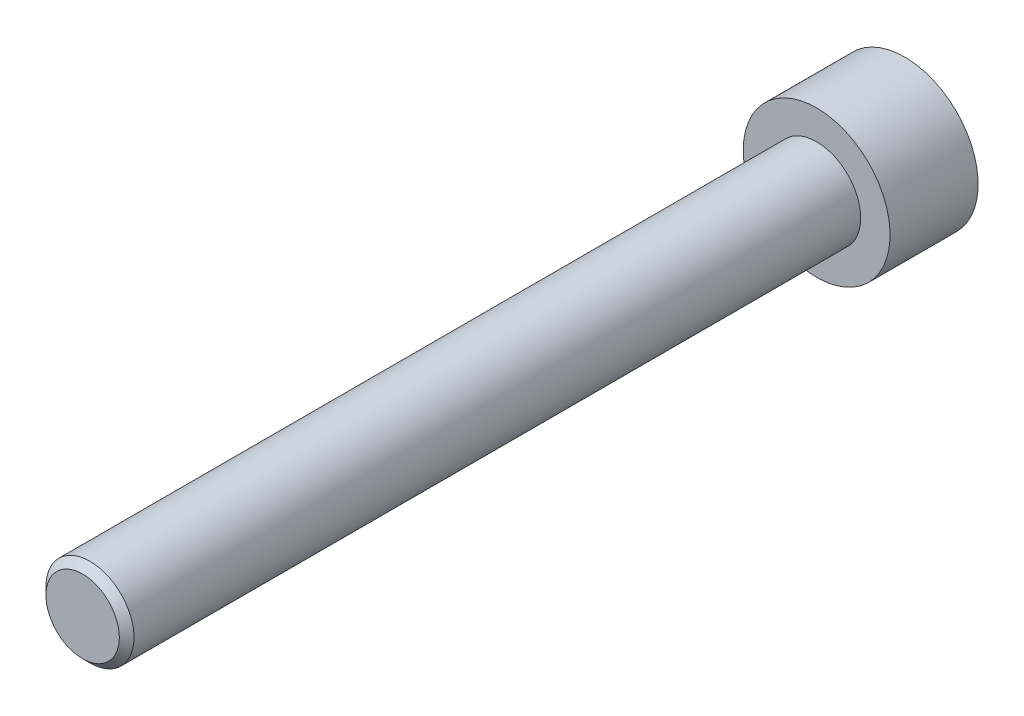
ISO-10303-21;
HEADER;
FILE_DESCRIPTION(('STEP AP214'),'2;1');
FILE_NAME('part.step','',(''),(''),'','','');
FILE_SCHEMA(('AUTOMOTIVE_DESIGN { 1 0 10303 214 1 1 1 1 }'));
ENDSEC;
DATA;
#1=APPLICATION_CONTEXT('core data for automotive mechanical design processes');
#2=APPLICATION_PROTOCOL_DEFINITION('international standard','automotive_design',2000,#1);
#3=PRODUCT_CONTEXT('',#1,'mechanical');
#4=PRODUCT('Part','Part','',(#3));
#5=PRODUCT_RELATED_PRODUCT_CATEGORY('part','',(#4));
#6=PRODUCT_DEFINITION_FORMATION('','',#4);
#7=PRODUCT_DEFINITION_CONTEXT('part definition',#1,'design');
#8=PRODUCT_DEFINITION('design','',#6,#7);
#9=PRODUCT_DEFINITION_SHAPE('','',#8);
#10=(LENGTH_UNIT() NAMED_UNIT(*) SI_UNIT(.MILLI.,.METRE.));
#11=(NAMED_UNIT(*) PLANE_ANGLE_UNIT() SI_UNIT($,.RADIAN.));
#12=(NAMED_UNIT(*) SI_UNIT($,.STERADIAN.) SOLID_ANGLE_UNIT());
#13=UNCERTAINTY_MEASURE_WITH_UNIT(LENGTH_MEASURE(1.E-05),#10,'distance_accuracy_value','');
#14=(GEOMETRIC_REPRESENTATION_CONTEXT(3) GLOBAL_UNCERTAINTY_ASSIGNED_CONTEXT((#13)) GLOBAL_UNIT_ASSIGNED_CONTEXT((#10,
#11,#12)) REPRESENTATION_CONTEXT('',''));
#15=CARTESIAN_POINT('',(0.,0.,0.));
#16=DIRECTION('',(0.,0.,1.));
#17=DIRECTION('',(1.,0.,0.));
#18=AXIS2_PLACEMENT_3D('',#15,#16,#17);
#19=CARTESIAN_POINT('',(0.,0.,-55.2));
#20=DIRECTION('',(0.,0.,1.));
#21=DIRECTION('',(1.,0.,0.));
#22=AXIS2_PLACEMENT_3D('',#19,#20,#21);
#23=CYLINDRICAL_SURFACE('',#22,3.);
#24=CARTESIAN_POINT('',(0.,0.,0.299999999999995));
#25=DIRECTION('',(0.,0.,1.));
#26=DIRECTION('',(1.,0.,0.));
#27=AXIS2_PLACEMENT_3D('',#24,#25,#26);
#28=CIRCLE('',#27,3.);
#29=CARTESIAN_POINT('',(3.,0.,0.299999999999995));
#30=VERTEX_POINT('',#29);
#31=EDGE_CURVE('E50',#30,#30,#28,.F.);
#32=ORIENTED_EDGE('',*,*,#31,.T.);
#33=EDGE_LOOP('',(#32));
#34=FACE_BOUND('',#33,.T.);
#35=CARTESIAN_POINT('',(0.,0.,-49.2));
#36=DIRECTION('',(0.,0.,-1.));
#37=DIRECTION('',(-1.,0.,0.));
#38=AXIS2_PLACEMENT_3D('',#35,#36,#37);
#39=CIRCLE('',#38,3.);
#40=CARTESIAN_POINT('',(-3.,0.,-49.2));
#41=VERTEX_POINT('',#40);
#42=EDGE_CURVE('E45',#41,#41,#39,.F.);
#43=ORIENTED_EDGE('',*,*,#42,.T.);
#44=EDGE_LOOP('',(#43));
#45=FACE_BOUND('',#44,.T.);
#46=ADVANCED_FACE('F40',(#34,#45),#23,.T.);
#47=CARTESIAN_POINT('',(0.,0.,0.8));
#48=DIRECTION('',(0.,0.,1.));
#49=DIRECTION('',(1.,0.,0.));
#50=AXIS2_PLACEMENT_3D('',#47,#48,#49);
#51=PLANE('',#50);
#52=CARTESIAN_POINT('',(0.,0.,0.8));
#53=DIRECTION('',(0.,0.,1.));
#54=DIRECTION('',(1.,0.,0.));
#55=AXIS2_PLACEMENT_3D('',#52,#53,#54);
#56=CIRCLE('',#55,2.5);
#57=CARTESIAN_POINT('',(2.5,0.,0.8));
#58=VERTEX_POINT('',#57);
#59=EDGE_CURVE('E11',#58,#58,#56,.T.);
#60=ORIENTED_EDGE('',*,*,#59,.T.);
#61=EDGE_LOOP('',(#60));
#62=FACE_BOUND('',#61,.T.);
#63=ADVANCED_FACE('F187',(#62),#51,.T.);
#64=CARTESIAN_POINT('',(0.,0.,0.800000000000002));
#65=DIRECTION('',(0.,0.,-1.));
#66=DIRECTION('',(-1.,0.,0.));
#67=AXIS2_PLACEMENT_3D('',#64,#65,#66);
#68=CONICAL_SURFACE('',#67,2.5,0.785398163397446);
#69=ORIENTED_EDGE('',*,*,#31,.F.);
#70=EDGE_LOOP('',(#69));
#71=FACE_BOUND('',#70,.T.);
#72=ORIENTED_EDGE('',*,*,#59,.F.);
#73=EDGE_LOOP('',(#72));
#74=FACE_BOUND('',#73,.T.);
#75=ADVANCED_FACE('F43',(#71,#74),#68,.T.);
#76=CARTESIAN_POINT('',(0.,0.,-49.2));
#77=DIRECTION('',(0.,0.,-1.));
#78=DIRECTION('',(-1.,0.,0.));
#79=AXIS2_PLACEMENT_3D('',#76,#77,#78);
#80=CYLINDRICAL_SURFACE('',#79,5.);
#81=CARTESIAN_POINT('',(0.,0.,-49.2));
#82=DIRECTION('',(0.,0.,-1.));
#83=DIRECTION('',(-1.,0.,0.));
#84=AXIS2_PLACEMENT_3D('',#81,#82,#83);
#85=CIRCLE('',#84,5.);
#86=CARTESIAN_POINT('',(-5.,0.,-49.2));
#87=VERTEX_POINT('',#86);
#88=EDGE_CURVE('E150',#87,#87,#85,.T.);
#89=ORIENTED_EDGE('',*,*,#88,.T.);
#90=EDGE_LOOP('',(#89));
#91=FACE_BOUND('',#90,.T.);
#92=CARTESIAN_POINT('',(0.,0.,-55.2));
#93=DIRECTION('',(0.,0.,-1.));
#94=DIRECTION('',(-1.,0.,0.));
#95=AXIS2_PLACEMENT_3D('',#92,#93,#94);
#96=CIRCLE('',#95,5.);
#97=CARTESIAN_POINT('',(-5.,0.,-55.2));
#98=VERTEX_POINT('',#97);
#99=EDGE_CURVE('E144',#98,#98,#96,.T.);
#100=ORIENTED_EDGE('',*,*,#99,.F.);
#101=EDGE_LOOP('',(#100));
#102=FACE_BOUND('',#101,.T.);
#103=ADVANCED_FACE('F166',(#91,#102),#80,.T.);
#104=CARTESIAN_POINT('',(0.,0.,-49.2));
#105=DIRECTION('',(0.,0.,-1.));
#106=DIRECTION('',(-1.,0.,0.));
#107=AXIS2_PLACEMENT_3D('',#104,#105,#106);
#108=PLANE('',#107);
#109=ORIENTED_EDGE('',*,*,#42,.F.);
#110=EDGE_LOOP('',(#109));
#111=FACE_BOUND('',#110,.T.);
#112=ORIENTED_EDGE('',*,*,#88,.F.);
#113=EDGE_LOOP('',(#112));
#114=FACE_BOUND('',#113,.T.);
#115=ADVANCED_FACE('F162',(#111,#114),#108,.F.);
#116=CARTESIAN_POINT('',(0.,0.,-55.2));
#117=DIRECTION('',(0.,0.,1.));
#118=DIRECTION('',(1.,0.,0.));
#119=AXIS2_PLACEMENT_3D('',#116,#117,#118);
#120=PLANE('',#119);
#121=DIRECTION('',(0.499999999999998,0.86602540378444,0.));
#122=VECTOR('',#121,1.);
#123=CARTESIAN_POINT('',(-1.5,3.,-55.2));
#124=LINE('',#123,#122);
#125=CARTESIAN_POINT('',(-3.23205080756887,0.,-55.2));
#126=VERTEX_POINT('',#125);
#127=CARTESIAN_POINT('',(-1.5,3.,-55.2));
#128=VERTEX_POINT('',#127);
#129=EDGE_CURVE('E131',#126,#128,#124,.T.);
#130=ORIENTED_EDGE('',*,*,#129,.F.);
#131=DIRECTION('',(-0.499999999999998,0.86602540378444,0.));
#132=VECTOR('',#131,1.);
#133=CARTESIAN_POINT('',(-1.5,-3.,-55.2));
#134=LINE('',#133,#132);
#135=CARTESIAN_POINT('',(-1.5,-3.,-55.2));
#136=VERTEX_POINT('',#135);
#137=EDGE_CURVE('E57',#136,#126,#134,.T.);
#138=ORIENTED_EDGE('',*,*,#137,.F.);
#139=DIRECTION('',(-1.,0.,0.));
#140=VECTOR('',#139,1.);
#141=CARTESIAN_POINT('',(-1.5,-3.,-55.2));
#142=LINE('',#141,#140);
#143=CARTESIAN_POINT('',(1.5,-3.,-55.2));
#144=VERTEX_POINT('',#143);
#145=EDGE_CURVE('E140',#144,#136,#142,.T.);
#146=ORIENTED_EDGE('',*,*,#145,.F.);
#147=DIRECTION('',(-0.499999999999997,-0.86602540378444,0.));
#148=VECTOR('',#147,1.);
#149=CARTESIAN_POINT('',(1.5,-3.,-55.2));
#150=LINE('',#149,#148);
#151=CARTESIAN_POINT('',(3.23205080756887,0.,-55.2));
#152=VERTEX_POINT('',#151);
#153=EDGE_CURVE('E138',#152,#144,#150,.T.);
#154=ORIENTED_EDGE('',*,*,#153,.F.);
#155=DIRECTION('',(0.499999999999998,-0.86602540378444,0.));
#156=VECTOR('',#155,1.);
#157=CARTESIAN_POINT('',(1.5,3.,-55.2));
#158=LINE('',#157,#156);
#159=CARTESIAN_POINT('',(1.5,3.,-55.2));
#160=VERTEX_POINT('',#159);
#161=EDGE_CURVE('E105',#160,#152,#158,.T.);
#162=ORIENTED_EDGE('',*,*,#161,.F.);
#163=DIRECTION('',(1.,0.,0.));
#164=VECTOR('',#163,1.);
#165=CARTESIAN_POINT('',(-1.5,3.,-55.2));
#166=LINE('',#165,#164);
#167=EDGE_CURVE('E134',#128,#160,#166,.T.);
#168=ORIENTED_EDGE('',*,*,#167,.F.);
#169=EDGE_LOOP('',(#130,#138,#146,#154,#162,#168));
#170=FACE_BOUND('',#169,.T.);
#171=ORIENTED_EDGE('',*,*,#99,.T.);
#172=EDGE_LOOP('',(#171));
#173=FACE_BOUND('',#172,.T.);
#174=ADVANCED_FACE('F165',(#170,#173),#120,.F.);
#175=CARTESIAN_POINT('',(-1.5,-3.,-53.2));
#176=DIRECTION('',(-0.86602540378444,-0.499999999999998,0.));
#177=DIRECTION('',(0.499999999999998,-0.86602540378444,0.));
#178=AXIS2_PLACEMENT_3D('',#175,#176,#177);
#179=PLANE('',#178);
#180=ORIENTED_EDGE('',*,*,#137,.T.);
#181=DIRECTION('',(0.,0.,-1.));
#182=VECTOR('',#181,1.);
#183=CARTESIAN_POINT('',(-3.23205080756887,0.,-53.2));
#184=LINE('',#183,#182);
#185=CARTESIAN_POINT('',(-3.23205080756887,0.,-53.2));
#186=VERTEX_POINT('',#185);
#187=EDGE_CURVE('E87',#186,#126,#184,.T.);
#188=ORIENTED_EDGE('',*,*,#187,.F.);
#189=DIRECTION('',(-0.499999999999998,0.86602540378444,0.));
#190=VECTOR('',#189,1.);
#191=CARTESIAN_POINT('',(-1.5,-3.,-53.2));
#192=LINE('',#191,#190);
#193=CARTESIAN_POINT('',(-1.5,-3.,-53.2));
#194=VERTEX_POINT('',#193);
#195=EDGE_CURVE('E142',#194,#186,#192,.T.);
#196=ORIENTED_EDGE('',*,*,#195,.F.);
#197=DIRECTION('',(0.,0.,-1.));
#198=VECTOR('',#197,1.);
#199=CARTESIAN_POINT('',(-1.5,-3.,-53.2));
#200=LINE('',#199,#198);
#201=EDGE_CURVE('E65',#194,#136,#200,.T.);
#202=ORIENTED_EDGE('',*,*,#201,.T.);
#203=EDGE_LOOP('',(#180,#188,#196,#202));
#204=FACE_BOUND('',#203,.T.);
#205=ADVANCED_FACE('F176',(#204),#179,.F.);
#206=CARTESIAN_POINT('',(-1.5,-3.,-53.2));
#207=DIRECTION('',(0.,-1.,0.));
#208=DIRECTION('',(0.,0.,-1.));
#209=AXIS2_PLACEMENT_3D('',#206,#207,#208);
#210=PLANE('',#209);
#211=ORIENTED_EDGE('',*,*,#145,.T.);
#212=ORIENTED_EDGE('',*,*,#201,.F.);
#213=DIRECTION('',(-1.,0.,0.));
#214=VECTOR('',#213,1.);
#215=CARTESIAN_POINT('',(-1.5,-3.,-53.2));
#216=LINE('',#215,#214);
#217=CARTESIAN_POINT('',(1.5,-3.,-53.2));
#218=VERTEX_POINT('',#217);
#219=EDGE_CURVE('E117',#218,#194,#216,.T.);
#220=ORIENTED_EDGE('',*,*,#219,.F.);
#221=DIRECTION('',(0.,0.,-1.));
#222=VECTOR('',#221,1.);
#223=CARTESIAN_POINT('',(1.5,-3.,-53.2));
#224=LINE('',#223,#222);
#225=EDGE_CURVE('E109',#218,#144,#224,.T.);
#226=ORIENTED_EDGE('',*,*,#225,.T.);
#227=EDGE_LOOP('',(#211,#212,#220,#226));
#228=FACE_BOUND('',#227,.T.);
#229=ADVANCED_FACE('F182',(#228),#210,.F.);
#230=CARTESIAN_POINT('',(1.5,-3.,-53.2));
#231=DIRECTION('',(0.86602540378444,-0.499999999999997,0.));
#232=DIRECTION('',(0.499999999999997,0.86602540378444,0.));
#233=AXIS2_PLACEMENT_3D('',#230,#231,#232);
#234=PLANE('',#233);
#235=ORIENTED_EDGE('',*,*,#153,.T.);
#236=ORIENTED_EDGE('',*,*,#225,.F.);
#237=DIRECTION('',(-0.499999999999997,-0.86602540378444,0.));
#238=VECTOR('',#237,1.);
#239=CARTESIAN_POINT('',(1.5,-3.,-53.2));
#240=LINE('',#239,#238);
#241=CARTESIAN_POINT('',(3.23205080756887,0.,-53.2));
#242=VERTEX_POINT('',#241);
#243=EDGE_CURVE('E113',#242,#218,#240,.T.);
#244=ORIENTED_EDGE('',*,*,#243,.F.);
#245=DIRECTION('',(0.,0.,-1.));
#246=VECTOR('',#245,1.);
#247=CARTESIAN_POINT('',(3.23205080756887,0.,-53.2));
#248=LINE('',#247,#246);
#249=EDGE_CURVE('E98',#242,#152,#248,.T.);
#250=ORIENTED_EDGE('',*,*,#249,.T.);
#251=EDGE_LOOP('',(#235,#236,#244,#250));
#252=FACE_BOUND('',#251,.T.);
#253=ADVANCED_FACE('F114',(#252),#234,.F.);
#254=CARTESIAN_POINT('',(1.5,3.,-53.2));
#255=DIRECTION('',(0.86602540378444,0.499999999999998,0.));
#256=DIRECTION('',(-0.499999999999998,0.86602540378444,0.));
#257=AXIS2_PLACEMENT_3D('',#254,#255,#256);
#258=PLANE('',#257);
#259=ORIENTED_EDGE('',*,*,#161,.T.);
#260=ORIENTED_EDGE('',*,*,#249,.F.);
#261=DIRECTION('',(0.499999999999998,-0.86602540378444,0.));
#262=VECTOR('',#261,1.);
#263=CARTESIAN_POINT('',(1.5,3.,-53.2));
#264=LINE('',#263,#262);
#265=CARTESIAN_POINT('',(1.5,3.,-53.2));
#266=VERTEX_POINT('',#265);
#267=EDGE_CURVE('E102',#266,#242,#264,.T.);
#268=ORIENTED_EDGE('',*,*,#267,.F.);
#269=DIRECTION('',(0.,0.,-1.));
#270=VECTOR('',#269,1.);
#271=CARTESIAN_POINT('',(1.5,3.,-53.2));
#272=LINE('',#271,#270);
#273=EDGE_CURVE('E110',#266,#160,#272,.T.);
#274=ORIENTED_EDGE('',*,*,#273,.T.);
#275=EDGE_LOOP('',(#259,#260,#268,#274));
#276=FACE_BOUND('',#275,.T.);
#277=ADVANCED_FACE('F100',(#276),#258,.F.);
#278=CARTESIAN_POINT('',(-1.5,3.,-53.2));
#279=DIRECTION('',(0.,1.,0.));
#280=DIRECTION('',(0.,0.,1.));
#281=AXIS2_PLACEMENT_3D('',#278,#279,#280);
#282=PLANE('',#281);
#283=ORIENTED_EDGE('',*,*,#167,.T.);
#284=ORIENTED_EDGE('',*,*,#273,.F.);
#285=DIRECTION('',(1.,0.,0.));
#286=VECTOR('',#285,1.);
#287=CARTESIAN_POINT('',(-1.5,3.,-53.2));
#288=LINE('',#287,#286);
#289=CARTESIAN_POINT('',(-1.5,3.,-53.2));
#290=VERTEX_POINT('',#289);
#291=EDGE_CURVE('E123',#290,#266,#288,.T.);
#292=ORIENTED_EDGE('',*,*,#291,.F.);
#293=DIRECTION('',(0.,0.,-1.));
#294=VECTOR('',#293,1.);
#295=CARTESIAN_POINT('',(-1.5,3.,-53.2));
#296=LINE('',#295,#294);
#297=EDGE_CURVE('E147',#290,#128,#296,.T.);
#298=ORIENTED_EDGE('',*,*,#297,.T.);
#299=EDGE_LOOP('',(#283,#284,#292,#298));
#300=FACE_BOUND('',#299,.T.);
#301=ADVANCED_FACE('F200',(#300),#282,.F.);
#302=CARTESIAN_POINT('',(-1.5,3.,-53.2));
#303=DIRECTION('',(-0.86602540378444,0.499999999999998,0.));
#304=DIRECTION('',(-0.499999999999998,-0.86602540378444,0.));
#305=AXIS2_PLACEMENT_3D('',#302,#303,#304);
#306=PLANE('',#305);
#307=ORIENTED_EDGE('',*,*,#129,.T.);
#308=ORIENTED_EDGE('',*,*,#297,.F.);
#309=DIRECTION('',(0.499999999999998,0.86602540378444,0.));
#310=VECTOR('',#309,1.);
#311=CARTESIAN_POINT('',(-1.5,3.,-53.2));
#312=LINE('',#311,#310);
#313=EDGE_CURVE('E125',#186,#290,#312,.T.);
#314=ORIENTED_EDGE('',*,*,#313,.F.);
#315=ORIENTED_EDGE('',*,*,#187,.T.);
#316=EDGE_LOOP('',(#307,#308,#314,#315));
#317=FACE_BOUND('',#316,.T.);
#318=ADVANCED_FACE('F197',(#317),#306,.F.);
#319=CARTESIAN_POINT('',(0.,0.,-53.2));
#320=DIRECTION('',(0.,0.,1.));
#321=DIRECTION('',(1.,0.,0.));
#322=AXIS2_PLACEMENT_3D('',#319,#320,#321);
#323=PLANE('',#322);
#324=ORIENTED_EDGE('',*,*,#195,.T.);
#325=ORIENTED_EDGE('',*,*,#313,.T.);
#326=ORIENTED_EDGE('',*,*,#291,.T.);
#327=ORIENTED_EDGE('',*,*,#267,.T.);
#328=ORIENTED_EDGE('',*,*,#243,.T.);
#329=ORIENTED_EDGE('',*,*,#219,.T.);
#330=EDGE_LOOP('',(#324,#325,#326,#327,#328,#329));
#331=FACE_BOUND('',#330,.T.);
#332=ADVANCED_FACE('F120',(#331),#323,.F.);
#333=CLOSED_SHELL('',(#46,#63,#75,#103,#115,#174,#205,#229,#253,#277,#301,#318,#332));
#334=MANIFOLD_SOLID_BREP('B2',#333);
#335=ADVANCED_BREP_SHAPE_REPRESENTATION('',(#18,#334),#14);
#336=SHAPE_DEFINITION_REPRESENTATION(#9,#335);
ENDSEC;
END-ISO-10303-21;
